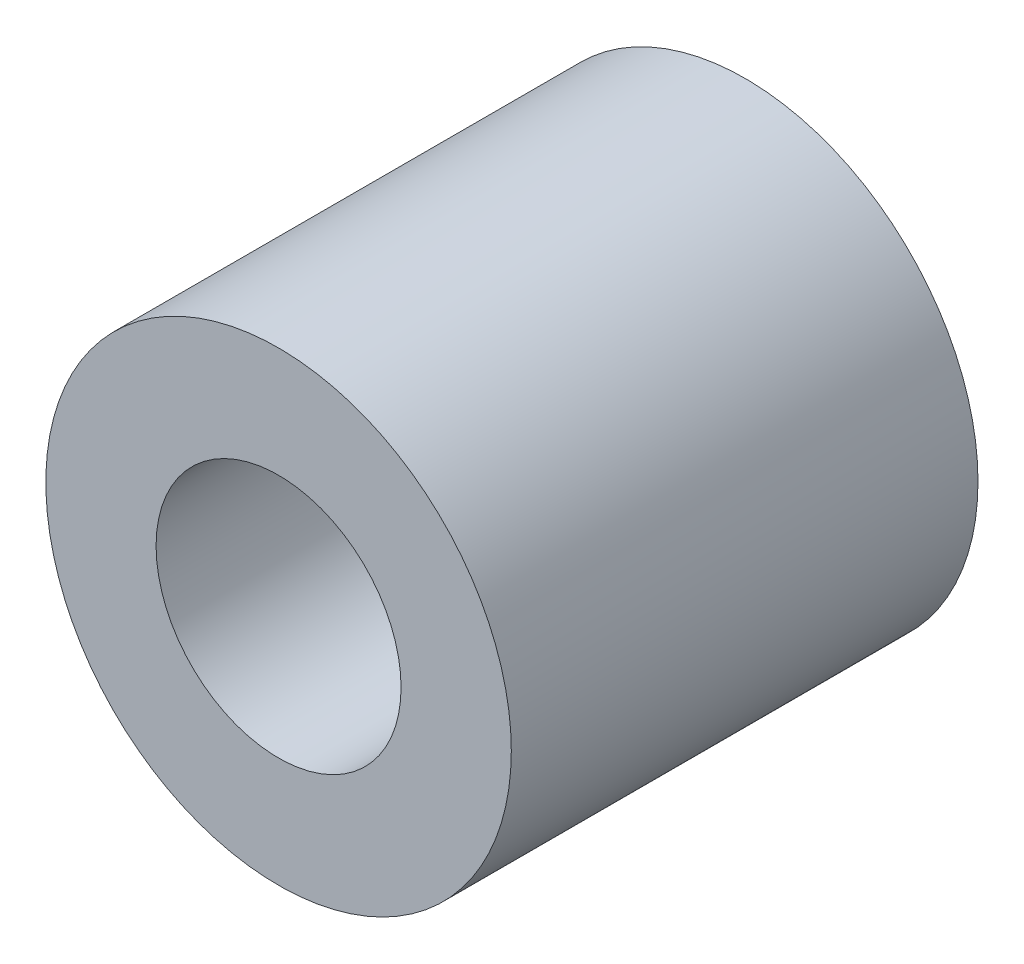
ISO-10303-21;
HEADER;
FILE_DESCRIPTION(('STEP AP214'),'2;1');
FILE_NAME('part.step','',(''),(''),'','','');
FILE_SCHEMA(('AUTOMOTIVE_DESIGN { 1 0 10303 214 1 1 1 1 }'));
ENDSEC;
DATA;
#1=APPLICATION_CONTEXT('core data for automotive mechanical design processes');
#2=APPLICATION_PROTOCOL_DEFINITION('international standard','automotive_design',2000,#1);
#3=PRODUCT_CONTEXT('',#1,'mechanical');
#4=PRODUCT('Part','Part','',(#3));
#5=PRODUCT_RELATED_PRODUCT_CATEGORY('part','',(#4));
#6=PRODUCT_DEFINITION_FORMATION('','',#4);
#7=PRODUCT_DEFINITION_CONTEXT('part definition',#1,'design');
#8=PRODUCT_DEFINITION('design','',#6,#7);
#9=PRODUCT_DEFINITION_SHAPE('','',#8);
#10=(LENGTH_UNIT() NAMED_UNIT(*) SI_UNIT(.MILLI.,.METRE.));
#11=(NAMED_UNIT(*) PLANE_ANGLE_UNIT() SI_UNIT($,.RADIAN.));
#12=(NAMED_UNIT(*) SI_UNIT($,.STERADIAN.) SOLID_ANGLE_UNIT());
#13=UNCERTAINTY_MEASURE_WITH_UNIT(LENGTH_MEASURE(1.E-05),#10,'distance_accuracy_value','');
#14=(GEOMETRIC_REPRESENTATION_CONTEXT(3) GLOBAL_UNCERTAINTY_ASSIGNED_CONTEXT((#13)) GLOBAL_UNIT_ASSIGNED_CONTEXT((#10,
#11,#12)) REPRESENTATION_CONTEXT('',''));
#15=CARTESIAN_POINT('',(0.,0.,0.));
#16=DIRECTION('',(0.,0.,1.));
#17=DIRECTION('',(1.,0.,0.));
#18=AXIS2_PLACEMENT_3D('',#15,#16,#17);
#19=CARTESIAN_POINT('',(0.,0.,-4.7625));
#20=DIRECTION('',(0.,0.,1.));
#21=DIRECTION('',(1.,0.,0.));
#22=AXIS2_PLACEMENT_3D('',#19,#20,#21);
#23=CYLINDRICAL_SURFACE('',#22,4.75);
#24=CARTESIAN_POINT('',(0.,0.,-4.7625));
#25=DIRECTION('',(0.,0.,1.));
#26=DIRECTION('',(1.,0.,0.));
#27=AXIS2_PLACEMENT_3D('',#24,#25,#26);
#28=CIRCLE('',#27,4.75);
#29=CARTESIAN_POINT('',(4.75,0.,-4.7625));
#30=VERTEX_POINT('',#29);
#31=EDGE_CURVE('E10',#30,#30,#28,.T.);
#32=ORIENTED_EDGE('',*,*,#31,.T.);
#33=EDGE_LOOP('',(#32));
#34=FACE_BOUND('',#33,.T.);
#35=CARTESIAN_POINT('',(0.,0.,4.7625));
#36=DIRECTION('',(0.,0.,1.));
#37=DIRECTION('',(1.,0.,0.));
#38=AXIS2_PLACEMENT_3D('',#35,#36,#37);
#39=CIRCLE('',#38,4.75);
#40=CARTESIAN_POINT('',(4.75,0.,4.7625));
#41=VERTEX_POINT('',#40);
#42=EDGE_CURVE('E44',#41,#41,#39,.T.);
#43=ORIENTED_EDGE('',*,*,#42,.F.);
#44=EDGE_LOOP('',(#43));
#45=FACE_BOUND('',#44,.T.);
#46=ADVANCED_FACE('F30',(#34,#45),#23,.T.);
#47=CARTESIAN_POINT('',(4.75,0.,-4.7625));
#48=DIRECTION('',(0.,0.,-1.));
#49=DIRECTION('',(-1.,0.,0.));
#50=AXIS2_PLACEMENT_3D('',#47,#48,#49);
#51=PLANE('',#50);
#52=CARTESIAN_POINT('',(0.,0.,-4.7625));
#53=DIRECTION('',(0.,0.,1.));
#54=DIRECTION('',(1.,0.,0.));
#55=AXIS2_PLACEMENT_3D('',#52,#53,#54);
#56=CIRCLE('',#55,2.5);
#57=CARTESIAN_POINT('',(2.5,0.,-4.7625));
#58=VERTEX_POINT('',#57);
#59=EDGE_CURVE('E36',#58,#58,#56,.T.);
#60=ORIENTED_EDGE('',*,*,#59,.T.);
#61=EDGE_LOOP('',(#60));
#62=FACE_BOUND('',#61,.T.);
#63=ORIENTED_EDGE('',*,*,#31,.F.);
#64=EDGE_LOOP('',(#63));
#65=FACE_BOUND('',#64,.T.);
#66=ADVANCED_FACE('F54',(#62,#65),#51,.T.);
#67=CARTESIAN_POINT('',(0.,0.,-4.7625));
#68=DIRECTION('',(0.,0.,1.));
#69=DIRECTION('',(1.,0.,0.));
#70=AXIS2_PLACEMENT_3D('',#67,#68,#69);
#71=CYLINDRICAL_SURFACE('',#70,2.5);
#72=CARTESIAN_POINT('',(0.,0.,4.7625));
#73=DIRECTION('',(0.,0.,1.));
#74=DIRECTION('',(1.,0.,0.));
#75=AXIS2_PLACEMENT_3D('',#72,#73,#74);
#76=CIRCLE('',#75,2.5);
#77=CARTESIAN_POINT('',(2.5,0.,4.7625));
#78=VERTEX_POINT('',#77);
#79=EDGE_CURVE('E40',#78,#78,#76,.T.);
#80=ORIENTED_EDGE('',*,*,#79,.T.);
#81=EDGE_LOOP('',(#80));
#82=FACE_BOUND('',#81,.T.);
#83=ORIENTED_EDGE('',*,*,#59,.F.);
#84=EDGE_LOOP('',(#83));
#85=FACE_BOUND('',#84,.T.);
#86=ADVANCED_FACE('F58',(#82,#85),#71,.F.);
#87=CARTESIAN_POINT('',(2.5,0.,4.7625));
#88=DIRECTION('',(0.,0.,1.));
#89=DIRECTION('',(1.,0.,0.));
#90=AXIS2_PLACEMENT_3D('',#87,#88,#89);
#91=PLANE('',#90);
#92=ORIENTED_EDGE('',*,*,#42,.T.);
#93=EDGE_LOOP('',(#92));
#94=FACE_BOUND('',#93,.T.);
#95=ORIENTED_EDGE('',*,*,#79,.F.);
#96=EDGE_LOOP('',(#95));
#97=FACE_BOUND('',#96,.T.);
#98=ADVANCED_FACE('F50',(#94,#97),#91,.T.);
#99=CLOSED_SHELL('',(#46,#66,#86,#98));
#100=MANIFOLD_SOLID_BREP('B2',#99);
#101=ADVANCED_BREP_SHAPE_REPRESENTATION('',(#18,#100),#14);
#102=SHAPE_DEFINITION_REPRESENTATION(#9,#101);
ENDSEC;
END-ISO-10303-21;
